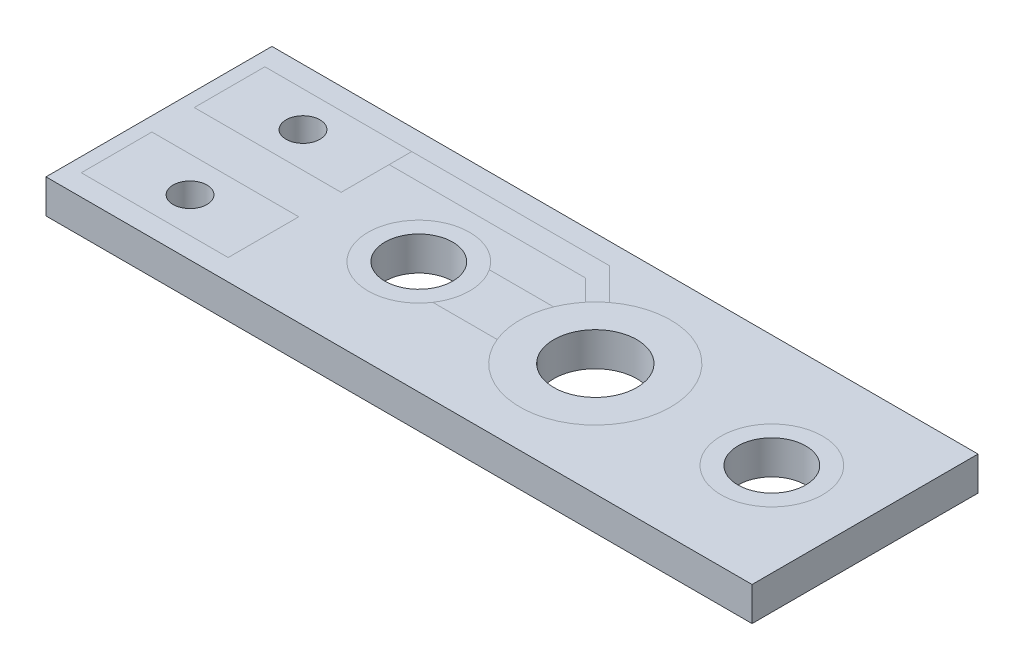
ISO-10303-21;
HEADER;
FILE_DESCRIPTION(('STEP AP214'),'2;1');
FILE_NAME('part.step','',(''),(''),'','','');
FILE_SCHEMA(('AUTOMOTIVE_DESIGN { 1 0 10303 214 1 1 1 1 }'));
ENDSEC;
DATA;
#1=APPLICATION_CONTEXT('core data for automotive mechanical design processes');
#2=APPLICATION_PROTOCOL_DEFINITION('international standard','automotive_design',2000,#1);
#3=PRODUCT_CONTEXT('',#1,'mechanical');
#4=PRODUCT('Part','Part','',(#3));
#5=PRODUCT_RELATED_PRODUCT_CATEGORY('part','',(#4));
#6=PRODUCT_DEFINITION_FORMATION('','',#4);
#7=PRODUCT_DEFINITION_CONTEXT('part definition',#1,'design');
#8=PRODUCT_DEFINITION('design','',#6,#7);
#9=PRODUCT_DEFINITION_SHAPE('','',#8);
#10=(LENGTH_UNIT() NAMED_UNIT(*) SI_UNIT(.MILLI.,.METRE.));
#11=(NAMED_UNIT(*) PLANE_ANGLE_UNIT() SI_UNIT($,.RADIAN.));
#12=(NAMED_UNIT(*) SI_UNIT($,.STERADIAN.) SOLID_ANGLE_UNIT());
#13=UNCERTAINTY_MEASURE_WITH_UNIT(LENGTH_MEASURE(1.E-05),#10,'distance_accuracy_value','');
#14=(GEOMETRIC_REPRESENTATION_CONTEXT(3) GLOBAL_UNCERTAINTY_ASSIGNED_CONTEXT((#13)) GLOBAL_UNIT_ASSIGNED_CONTEXT((#10,
#11,#12)) REPRESENTATION_CONTEXT('',''));
#15=CARTESIAN_POINT('',(0.,0.,0.));
#16=DIRECTION('',(0.,0.,1.));
#17=DIRECTION('',(1.,0.,0.));
#18=AXIS2_PLACEMENT_3D('',#15,#16,#17);
#19=CARTESIAN_POINT('',(0.,-0.762,0.));
#20=DIRECTION('',(0.,1.,0.));
#21=DIRECTION('',(0.,0.,-1.));
#22=AXIS2_PLACEMENT_3D('',#19,#20,#21);
#23=PLANE('',#22);
#24=DIRECTION('',(1.,0.,0.));
#25=VECTOR('',#24,1.);
#26=CARTESIAN_POINT('',(0.,-0.762,1.27));
#27=LINE('',#26,#25);
#28=CARTESIAN_POINT('',(6.89059014024725,-0.762,1.27));
#29=VERTEX_POINT('',#28);
#30=CARTESIAN_POINT('',(9.78323804751884,-0.762,1.27));
#31=VERTEX_POINT('',#30);
#32=EDGE_CURVE('E11',#29,#31,#27,.T.);
#33=ORIENTED_EDGE('',*,*,#32,.F.);
#34=CARTESIAN_POINT('',(3.7465,-0.762,0.));
#35=DIRECTION('',(0.,-1.,0.));
#36=DIRECTION('',(0.,0.,-1.));
#37=AXIS2_PLACEMENT_3D('',#34,#35,#36);
#38=CIRCLE('',#37,3.3909);
#39=CARTESIAN_POINT('',(6.89059014024725,-0.762,-1.27));
#40=VERTEX_POINT('',#39);
#41=EDGE_CURVE('E256',#29,#40,#38,.F.);
#42=ORIENTED_EDGE('',*,*,#41,.T.);
#43=DIRECTION('',(1.,0.,0.));
#44=VECTOR('',#43,1.);
#45=CARTESIAN_POINT('',(0.,-0.762,-1.27));
#46=LINE('',#45,#44);
#47=CARTESIAN_POINT('',(9.78323804751884,-0.762,-1.27));
#48=VERTEX_POINT('',#47);
#49=EDGE_CURVE('E49',#40,#48,#46,.T.);
#50=ORIENTED_EDGE('',*,*,#49,.T.);
#51=CARTESIAN_POINT('',(11.684,-0.762,0.));
#52=DIRECTION('',(0.,-1.,0.));
#53=DIRECTION('',(0.,0.,-1.));
#54=AXIS2_PLACEMENT_3D('',#51,#52,#53);
#55=CIRCLE('',#54,2.286);
#56=EDGE_CURVE('E257',#48,#31,#55,.F.);
#57=ORIENTED_EDGE('',*,*,#56,.T.);
#58=EDGE_LOOP('',(#33,#42,#50,#57));
#59=FACE_BOUND('',#58,.T.);
#60=ADVANCED_FACE('F40',(#59),#23,.F.);
#61=CARTESIAN_POINT('',(-4.191,-0.762,0.));
#62=DIRECTION('',(0.,-1.,0.));
#63=DIRECTION('',(0.,0.,-1.));
#64=AXIS2_PLACEMENT_3D('',#61,#62,#63);
#65=CIRCLE('',#64,2.286);
#66=CARTESIAN_POINT('',(-4.191,-0.762,-2.286));
#67=VERTEX_POINT('',#66);
#68=EDGE_CURVE('E247',#67,#67,#65,.F.);
#69=ORIENTED_EDGE('',*,*,#68,.T.);
#70=EDGE_LOOP('',(#69));
#71=FACE_BOUND('',#70,.T.);
#72=DIRECTION('',(-1.,0.,0.));
#73=VECTOR('',#72,1.);
#74=CARTESIAN_POINT('',(0.,-0.762,-0.952500000000002));
#75=LINE('',#74,#73);
#76=CARTESIAN_POINT('',(-8.636,-0.762,-0.952500000000002));
#77=VERTEX_POINT('',#76);
#78=CARTESIAN_POINT('',(-15.24,-0.762,-0.952500000000003));
#79=VERTEX_POINT('',#78);
#80=EDGE_CURVE('E240',#77,#79,#75,.T.);
#81=ORIENTED_EDGE('',*,*,#80,.F.);
#82=DIRECTION('',(0.,0.,1.));
#83=VECTOR('',#82,1.);
#84=CARTESIAN_POINT('',(-8.636,-0.762,0.));
#85=LINE('',#84,#83);
#86=CARTESIAN_POINT('',(-8.636,-0.762,-4.1275));
#87=VERTEX_POINT('',#86);
#88=EDGE_CURVE('E237',#87,#77,#85,.T.);
#89=ORIENTED_EDGE('',*,*,#88,.F.);
#90=DIRECTION('',(1.,0.,0.));
#91=VECTOR('',#90,1.);
#92=CARTESIAN_POINT('',(0.,-0.762,-4.1275));
#93=LINE('',#92,#91);
#94=CARTESIAN_POINT('',(-15.24,-0.762,-4.1275));
#95=VERTEX_POINT('',#94);
#96=EDGE_CURVE('E234',#95,#87,#93,.T.);
#97=ORIENTED_EDGE('',*,*,#96,.F.);
#98=DIRECTION('',(0.,0.,-1.));
#99=VECTOR('',#98,1.);
#100=CARTESIAN_POINT('',(-15.24,-0.762,0.));
#101=LINE('',#100,#99);
#102=EDGE_CURVE('E244',#79,#95,#101,.T.);
#103=ORIENTED_EDGE('',*,*,#102,.F.);
#104=EDGE_LOOP('',(#81,#89,#97,#103));
#105=FACE_BOUND('',#104,.T.);
#106=DIRECTION('',(0.,0.,1.));
#107=VECTOR('',#106,1.);
#108=CARTESIAN_POINT('',(-15.875,-0.762,-5.07999999999999));
#109=LINE('',#108,#107);
#110=CARTESIAN_POINT('',(-15.875,-0.762,-5.07999999999999));
#111=VERTEX_POINT('',#110);
#112=CARTESIAN_POINT('',(-15.875,-0.762,5.08));
#113=VERTEX_POINT('',#112);
#114=EDGE_CURVE('E199',#111,#113,#109,.T.);
#115=ORIENTED_EDGE('',*,*,#114,.F.);
#116=DIRECTION('',(-1.,0.,0.));
#117=VECTOR('',#116,1.);
#118=CARTESIAN_POINT('',(15.875,-0.762,-5.08));
#119=LINE('',#118,#117);
#120=CARTESIAN_POINT('',(15.875,-0.762,-5.08));
#121=VERTEX_POINT('',#120);
#122=EDGE_CURVE('E216',#121,#111,#119,.T.);
#123=ORIENTED_EDGE('',*,*,#122,.F.);
#124=DIRECTION('',(0.,0.,-1.));
#125=VECTOR('',#124,1.);
#126=CARTESIAN_POINT('',(15.875,-0.762,-5.08));
#127=LINE('',#126,#125);
#128=CARTESIAN_POINT('',(15.875,-0.762,5.08));
#129=VERTEX_POINT('',#128);
#130=EDGE_CURVE('E201',#129,#121,#127,.T.);
#131=ORIENTED_EDGE('',*,*,#130,.F.);
#132=DIRECTION('',(1.,0.,0.));
#133=VECTOR('',#132,1.);
#134=CARTESIAN_POINT('',(15.875,-0.762,5.08));
#135=LINE('',#134,#133);
#136=EDGE_CURVE('E185',#113,#129,#135,.T.);
#137=ORIENTED_EDGE('',*,*,#136,.F.);
#138=EDGE_LOOP('',(#115,#123,#131,#137));
#139=FACE_BOUND('',#138,.T.);
#140=CARTESIAN_POINT('',(1.68738577909666,-0.762,2.69411422090334));
#141=VERTEX_POINT('',#140);
#142=EDGE_CURVE('E252',#141,#29,#38,.F.);
#143=ORIENTED_EDGE('',*,*,#142,.T.);
#144=ORIENTED_EDGE('',*,*,#32,.T.);
#145=EDGE_CURVE('E255',#31,#48,#55,.F.);
#146=ORIENTED_EDGE('',*,*,#145,.T.);
#147=ORIENTED_EDGE('',*,*,#49,.F.);
#148=CARTESIAN_POINT('',(1.13769203312162,-0.762,2.16617723235008));
#149=VERTEX_POINT('',#148);
#150=EDGE_CURVE('E388',#40,#149,#38,.F.);
#151=ORIENTED_EDGE('',*,*,#150,.T.);
#152=DIRECTION('',(0.707106781186546,0.,-0.707106781186549));
#153=VECTOR('',#152,1.);
#154=CARTESIAN_POINT('',(1.65193463273585,-0.762,1.65193463273585));
#155=LINE('',#154,#153);
#156=CARTESIAN_POINT('',(0.192369265471702,-0.762,3.1115));
#157=VERTEX_POINT('',#156);
#158=EDGE_CURVE('E355',#157,#149,#155,.T.);
#159=ORIENTED_EDGE('',*,*,#158,.F.);
#160=DIRECTION('',(1.,0.,0.));
#161=VECTOR('',#160,1.);
#162=CARTESIAN_POINT('',(0.,-0.762,3.1115));
#163=LINE('',#162,#161);
#164=CARTESIAN_POINT('',(-8.636,-0.762,3.1115));
#165=VERTEX_POINT('',#164);
#166=EDGE_CURVE('E359',#165,#157,#163,.T.);
#167=ORIENTED_EDGE('',*,*,#166,.F.);
#168=DIRECTION('',(0.,0.,-1.));
#169=VECTOR('',#168,1.);
#170=CARTESIAN_POINT('',(-8.636,-0.762,0.));
#171=LINE('',#170,#169);
#172=CARTESIAN_POINT('',(-8.636,-0.762,0.952500000000002));
#173=VERTEX_POINT('',#172);
#174=EDGE_CURVE('E221',#165,#173,#171,.T.);
#175=ORIENTED_EDGE('',*,*,#174,.T.);
#176=DIRECTION('',(-1.,0.,0.));
#177=VECTOR('',#176,1.);
#178=CARTESIAN_POINT('',(0.,-0.762,0.952500000000002));
#179=LINE('',#178,#177);
#180=CARTESIAN_POINT('',(-15.24,-0.762,0.952500000000003));
#181=VERTEX_POINT('',#180);
#182=EDGE_CURVE('E218',#173,#181,#179,.T.);
#183=ORIENTED_EDGE('',*,*,#182,.T.);
#184=DIRECTION('',(0.,0.,1.));
#185=VECTOR('',#184,1.);
#186=CARTESIAN_POINT('',(-15.24,-0.762,0.));
#187=LINE('',#186,#185);
#188=CARTESIAN_POINT('',(-15.24,-0.762,4.1275));
#189=VERTEX_POINT('',#188);
#190=EDGE_CURVE('E230',#181,#189,#187,.T.);
#191=ORIENTED_EDGE('',*,*,#190,.T.);
#192=DIRECTION('',(1.,0.,0.));
#193=VECTOR('',#192,1.);
#194=CARTESIAN_POINT('',(0.,-0.762,4.1275));
#195=LINE('',#194,#193);
#196=CARTESIAN_POINT('',(-8.636,-0.762,4.1275));
#197=VERTEX_POINT('',#196);
#198=EDGE_CURVE('E226',#189,#197,#195,.T.);
#199=ORIENTED_EDGE('',*,*,#198,.T.);
#200=DIRECTION('',(1.,0.,0.));
#201=VECTOR('',#200,1.);
#202=CARTESIAN_POINT('',(0.,-0.762,4.1275));
#203=LINE('',#202,#201);
#204=CARTESIAN_POINT('',(0.254000000000001,-0.762,4.1275));
#205=VERTEX_POINT('',#204);
#206=EDGE_CURVE('E352',#197,#205,#203,.T.);
#207=ORIENTED_EDGE('',*,*,#206,.T.);
#208=DIRECTION('',(0.707106781186546,0.,-0.707106781186549));
#209=VECTOR('',#208,1.);
#210=CARTESIAN_POINT('',(2.19075,-0.762,2.19074999999999));
#211=LINE('',#210,#209);
#212=EDGE_CURVE('E348',#205,#141,#211,.T.);
#213=ORIENTED_EDGE('',*,*,#212,.T.);
#214=EDGE_LOOP('',(#143,#144,#146,#147,#151,#159,#167,#175,#183,#191,#199,#207,#213));
#215=FACE_BOUND('',#214,.T.);
#216=ADVANCED_FACE('F197',(#71,#105,#139,#215),#23,.F.);
#217=CARTESIAN_POINT('',(0.,0.762,0.));
#218=DIRECTION('',(0.,-1.,0.));
#219=DIRECTION('',(0.,0.,-1.));
#220=AXIS2_PLACEMENT_3D('',#217,#218,#219);
#221=PLANE('',#220);
#222=DIRECTION('',(0.,0.,1.));
#223=VECTOR('',#222,1.);
#224=CARTESIAN_POINT('',(-15.24,0.762,0.));
#225=LINE('',#224,#223);
#226=CARTESIAN_POINT('',(-15.24,0.762,0.952500000000003));
#227=VERTEX_POINT('',#226);
#228=CARTESIAN_POINT('',(-15.24,0.762,4.1275));
#229=VERTEX_POINT('',#228);
#230=EDGE_CURVE('E295',#227,#229,#225,.T.);
#231=ORIENTED_EDGE('',*,*,#230,.F.);
#232=DIRECTION('',(-1.,0.,0.));
#233=VECTOR('',#232,1.);
#234=CARTESIAN_POINT('',(0.,0.762,0.952500000000002));
#235=LINE('',#234,#233);
#236=CARTESIAN_POINT('',(-8.636,0.762,0.952500000000002));
#237=VERTEX_POINT('',#236);
#238=EDGE_CURVE('E192',#237,#227,#235,.T.);
#239=ORIENTED_EDGE('',*,*,#238,.F.);
#240=DIRECTION('',(0.,0.,-1.));
#241=VECTOR('',#240,1.);
#242=CARTESIAN_POINT('',(-8.636,0.762,0.));
#243=LINE('',#242,#241);
#244=CARTESIAN_POINT('',(-8.636,0.762,4.1275));
#245=VERTEX_POINT('',#244);
#246=EDGE_CURVE('E289',#245,#237,#243,.T.);
#247=ORIENTED_EDGE('',*,*,#246,.F.);
#248=DIRECTION('',(1.,0.,0.));
#249=VECTOR('',#248,1.);
#250=CARTESIAN_POINT('',(0.,0.762,4.1275));
#251=LINE('',#250,#249);
#252=EDGE_CURVE('E292',#229,#245,#251,.T.);
#253=ORIENTED_EDGE('',*,*,#252,.F.);
#254=EDGE_LOOP('',(#231,#239,#247,#253));
#255=FACE_BOUND('',#254,.T.);
#256=DIRECTION('',(0.,0.,1.));
#257=VECTOR('',#256,1.);
#258=CARTESIAN_POINT('',(-15.875,0.762,-5.07999999999999));
#259=LINE('',#258,#257);
#260=CARTESIAN_POINT('',(-15.875,0.762,-5.07999999999999));
#261=VERTEX_POINT('',#260);
#262=CARTESIAN_POINT('',(-15.875,0.762,5.08));
#263=VERTEX_POINT('',#262);
#264=EDGE_CURVE('E270',#261,#263,#259,.T.);
#265=ORIENTED_EDGE('',*,*,#264,.T.);
#266=DIRECTION('',(1.,0.,0.));
#267=VECTOR('',#266,1.);
#268=CARTESIAN_POINT('',(15.875,0.762,5.08));
#269=LINE('',#268,#267);
#270=CARTESIAN_POINT('',(15.875,0.762,5.08));
#271=VERTEX_POINT('',#270);
#272=EDGE_CURVE('E187',#263,#271,#269,.T.);
#273=ORIENTED_EDGE('',*,*,#272,.T.);
#274=DIRECTION('',(0.,0.,-1.));
#275=VECTOR('',#274,1.);
#276=CARTESIAN_POINT('',(15.875,0.762,-5.08));
#277=LINE('',#276,#275);
#278=CARTESIAN_POINT('',(15.875,0.762,-5.08));
#279=VERTEX_POINT('',#278);
#280=EDGE_CURVE('E278',#271,#279,#277,.T.);
#281=ORIENTED_EDGE('',*,*,#280,.T.);
#282=DIRECTION('',(-1.,0.,0.));
#283=VECTOR('',#282,1.);
#284=CARTESIAN_POINT('',(15.875,0.762,-5.08));
#285=LINE('',#284,#283);
#286=EDGE_CURVE('E280',#279,#261,#285,.T.);
#287=ORIENTED_EDGE('',*,*,#286,.T.);
#288=EDGE_LOOP('',(#265,#273,#281,#287));
#289=FACE_BOUND('',#288,.T.);
#290=CARTESIAN_POINT('',(11.684,0.762,0.));
#291=DIRECTION('',(0.,-1.,0.));
#292=DIRECTION('',(0.,0.,-1.));
#293=AXIS2_PLACEMENT_3D('',#290,#291,#292);
#294=CIRCLE('',#293,2.286);
#295=CARTESIAN_POINT('',(11.684,0.762,-2.286));
#296=VERTEX_POINT('',#295);
#297=EDGE_CURVE('E324',#296,#296,#294,.F.);
#298=ORIENTED_EDGE('',*,*,#297,.F.);
#299=EDGE_LOOP('',(#298));
#300=FACE_BOUND('',#299,.T.);
#301=DIRECTION('',(1.,0.,0.));
#302=VECTOR('',#301,1.);
#303=CARTESIAN_POINT('',(0.,0.762,-3.1115));
#304=LINE('',#303,#302);
#305=CARTESIAN_POINT('',(-8.636,0.762,-3.1115));
#306=VERTEX_POINT('',#305);
#307=CARTESIAN_POINT('',(0.192369265471702,0.762,-3.1115));
#308=VERTEX_POINT('',#307);
#309=EDGE_CURVE('E345',#306,#308,#304,.T.);
#310=ORIENTED_EDGE('',*,*,#309,.F.);
#311=DIRECTION('',(0.,0.,1.));
#312=VECTOR('',#311,1.);
#313=CARTESIAN_POINT('',(-8.636,0.762,0.));
#314=LINE('',#313,#312);
#315=CARTESIAN_POINT('',(-8.636,0.762,-0.952500000000002));
#316=VERTEX_POINT('',#315);
#317=EDGE_CURVE('E302',#306,#316,#314,.T.);
#318=ORIENTED_EDGE('',*,*,#317,.T.);
#319=DIRECTION('',(-1.,0.,0.));
#320=VECTOR('',#319,1.);
#321=CARTESIAN_POINT('',(0.,0.762,-0.952500000000002));
#322=LINE('',#321,#320);
#323=CARTESIAN_POINT('',(-15.24,0.762,-0.952500000000003));
#324=VERTEX_POINT('',#323);
#325=EDGE_CURVE('E307',#316,#324,#322,.T.);
#326=ORIENTED_EDGE('',*,*,#325,.T.);
#327=DIRECTION('',(0.,0.,-1.));
#328=VECTOR('',#327,1.);
#329=CARTESIAN_POINT('',(-15.24,0.762,0.));
#330=LINE('',#329,#328);
#331=CARTESIAN_POINT('',(-15.24,0.762,-4.1275));
#332=VERTEX_POINT('',#331);
#333=EDGE_CURVE('E311',#324,#332,#330,.T.);
#334=ORIENTED_EDGE('',*,*,#333,.T.);
#335=DIRECTION('',(1.,0.,0.));
#336=VECTOR('',#335,1.);
#337=CARTESIAN_POINT('',(0.,0.762,-4.1275));
#338=LINE('',#337,#336);
#339=CARTESIAN_POINT('',(-8.636,0.762,-4.1275));
#340=VERTEX_POINT('',#339);
#341=EDGE_CURVE('E298',#332,#340,#338,.T.);
#342=ORIENTED_EDGE('',*,*,#341,.T.);
#343=DIRECTION('',(1.,0.,0.));
#344=VECTOR('',#343,1.);
#345=CARTESIAN_POINT('',(0.,0.762,-4.1275));
#346=LINE('',#345,#344);
#347=CARTESIAN_POINT('',(0.254000000000002,0.762,-4.1275));
#348=VERTEX_POINT('',#347);
#349=EDGE_CURVE('E339',#340,#348,#346,.T.);
#350=ORIENTED_EDGE('',*,*,#349,.T.);
#351=DIRECTION('',(0.707106781186546,0.,0.707106781186549));
#352=VECTOR('',#351,1.);
#353=CARTESIAN_POINT('',(2.19075,0.762,-2.19075));
#354=LINE('',#353,#352);
#355=CARTESIAN_POINT('',(1.68738577909666,0.762,-2.69411422090334));
#356=VERTEX_POINT('',#355);
#357=EDGE_CURVE('E336',#348,#356,#354,.T.);
#358=ORIENTED_EDGE('',*,*,#357,.T.);
#359=CARTESIAN_POINT('',(3.7465,0.762,0.));
#360=DIRECTION('',(0.,-1.,0.));
#361=DIRECTION('',(0.,0.,-1.));
#362=AXIS2_PLACEMENT_3D('',#359,#360,#361);
#363=CIRCLE('',#362,3.3909);
#364=CARTESIAN_POINT('',(0.602409859752746,0.762,1.27));
#365=VERTEX_POINT('',#364);
#366=EDGE_CURVE('E325',#365,#356,#363,.F.);
#367=ORIENTED_EDGE('',*,*,#366,.F.);
#368=DIRECTION('',(1.,0.,0.));
#369=VECTOR('',#368,1.);
#370=CARTESIAN_POINT('',(0.,0.762,1.27));
#371=LINE('',#370,#369);
#372=CARTESIAN_POINT('',(-2.29023804751884,0.762,1.27));
#373=VERTEX_POINT('',#372);
#374=EDGE_CURVE('E333',#373,#365,#371,.T.);
#375=ORIENTED_EDGE('',*,*,#374,.F.);
#376=CARTESIAN_POINT('',(-4.191,0.762,0.));
#377=DIRECTION('',(0.,-1.,0.));
#378=DIRECTION('',(0.,0.,-1.));
#379=AXIS2_PLACEMENT_3D('',#376,#377,#378);
#380=CIRCLE('',#379,2.286);
#381=CARTESIAN_POINT('',(-2.29023804751884,0.762,-1.27));
#382=VERTEX_POINT('',#381);
#383=EDGE_CURVE('E315',#382,#373,#380,.F.);
#384=ORIENTED_EDGE('',*,*,#383,.F.);
#385=DIRECTION('',(1.,0.,0.));
#386=VECTOR('',#385,1.);
#387=CARTESIAN_POINT('',(0.,0.762,-1.27));
#388=LINE('',#387,#386);
#389=CARTESIAN_POINT('',(0.602409859752746,0.762,-1.27));
#390=VERTEX_POINT('',#389);
#391=EDGE_CURVE('E329',#382,#390,#388,.T.);
#392=ORIENTED_EDGE('',*,*,#391,.T.);
#393=CARTESIAN_POINT('',(1.13769203312162,0.762,-2.16617723235008));
#394=VERTEX_POINT('',#393);
#395=EDGE_CURVE('E319',#394,#390,#363,.F.);
#396=ORIENTED_EDGE('',*,*,#395,.F.);
#397=DIRECTION('',(0.707106781186546,0.,0.707106781186549));
#398=VECTOR('',#397,1.);
#399=CARTESIAN_POINT('',(1.65193463273585,0.762,-1.65193463273584));
#400=LINE('',#399,#398);
#401=EDGE_CURVE('E342',#308,#394,#400,.T.);
#402=ORIENTED_EDGE('',*,*,#401,.F.);
#403=EDGE_LOOP('',(#310,#318,#326,#334,#342,#350,#358,#367,#375,#384,#392,#396,#402));
#404=FACE_BOUND('',#403,.T.);
#405=ADVANCED_FACE('F482',(#255,#289,#300,#404),#221,.F.);
#406=EDGE_CURVE('E303',#340,#306,#314,.T.);
#407=ORIENTED_EDGE('',*,*,#406,.T.);
#408=ORIENTED_EDGE('',*,*,#309,.T.);
#409=ORIENTED_EDGE('',*,*,#401,.T.);
#410=EDGE_CURVE('E416',#356,#394,#363,.F.);
#411=ORIENTED_EDGE('',*,*,#410,.F.);
#412=ORIENTED_EDGE('',*,*,#357,.F.);
#413=ORIENTED_EDGE('',*,*,#349,.F.);
#414=EDGE_LOOP('',(#407,#408,#409,#411,#412,#413));
#415=FACE_BOUND('',#414,.T.);
#416=ADVANCED_FACE('F492',(#415),#221,.F.);
#417=EDGE_CURVE('E314',#373,#382,#380,.F.);
#418=ORIENTED_EDGE('',*,*,#417,.F.);
#419=ORIENTED_EDGE('',*,*,#374,.T.);
#420=EDGE_CURVE('E320',#390,#365,#363,.F.);
#421=ORIENTED_EDGE('',*,*,#420,.F.);
#422=ORIENTED_EDGE('',*,*,#391,.F.);
#423=EDGE_LOOP('',(#418,#419,#421,#422));
#424=FACE_BOUND('',#423,.T.);
#425=ADVANCED_FACE('F479',(#424),#221,.F.);
#426=ORIENTED_EDGE('',*,*,#297,.T.);
#427=EDGE_LOOP('',(#426));
#428=FACE_BOUND('',#427,.T.);
#429=CARTESIAN_POINT('',(11.684,0.762,0.));
#430=DIRECTION('',(0.,1.,0.));
#431=DIRECTION('',(0.,0.,1.));
#432=AXIS2_PLACEMENT_3D('',#429,#430,#431);
#433=CIRCLE('',#432,1.524);
#434=CARTESIAN_POINT('',(11.684,0.762,1.524));
#435=VERTEX_POINT('',#434);
#436=EDGE_CURVE('E266',#435,#435,#433,.T.);
#437=ORIENTED_EDGE('',*,*,#436,.F.);
#438=EDGE_LOOP('',(#437));
#439=FACE_BOUND('',#438,.T.);
#440=ADVANCED_FACE('F506',(#428,#439),#221,.F.);
#441=ORIENTED_EDGE('',*,*,#420,.T.);
#442=ORIENTED_EDGE('',*,*,#366,.T.);
#443=ORIENTED_EDGE('',*,*,#410,.T.);
#444=ORIENTED_EDGE('',*,*,#395,.T.);
#445=EDGE_LOOP('',(#441,#442,#443,#444));
#446=FACE_BOUND('',#445,.T.);
#447=CARTESIAN_POINT('',(3.7465,0.762,0.));
#448=DIRECTION('',(0.,1.,0.));
#449=DIRECTION('',(0.,0.,1.));
#450=AXIS2_PLACEMENT_3D('',#447,#448,#449);
#451=CIRCLE('',#450,1.8669);
#452=CARTESIAN_POINT('',(3.7465,0.762,1.8669));
#453=VERTEX_POINT('',#452);
#454=EDGE_CURVE('E271',#453,#453,#451,.T.);
#455=ORIENTED_EDGE('',*,*,#454,.F.);
#456=EDGE_LOOP('',(#455));
#457=FACE_BOUND('',#456,.T.);
#458=ADVANCED_FACE('F487',(#446,#457),#221,.F.);
#459=CARTESIAN_POINT('',(-11.938,0.762,-2.54));
#460=DIRECTION('',(0.,-1.,0.));
#461=DIRECTION('',(0.,0.,-1.));
#462=AXIS2_PLACEMENT_3D('',#459,#460,#461);
#463=CIRCLE('',#462,0.762000000000001);
#464=CARTESIAN_POINT('',(-11.938,0.762,-3.302));
#465=VERTEX_POINT('',#464);
#466=EDGE_CURVE('E260',#465,#465,#463,.T.);
#467=ORIENTED_EDGE('',*,*,#466,.T.);
#468=EDGE_LOOP('',(#467));
#469=FACE_BOUND('',#468,.T.);
#470=ORIENTED_EDGE('',*,*,#333,.F.);
#471=ORIENTED_EDGE('',*,*,#325,.F.);
#472=ORIENTED_EDGE('',*,*,#317,.F.);
#473=ORIENTED_EDGE('',*,*,#406,.F.);
#474=ORIENTED_EDGE('',*,*,#341,.F.);
#475=EDGE_LOOP('',(#470,#471,#472,#473,#474));
#476=FACE_BOUND('',#475,.T.);
#477=ADVANCED_FACE('F496',(#469,#476),#221,.F.);
#478=ORIENTED_EDGE('',*,*,#383,.T.);
#479=ORIENTED_EDGE('',*,*,#417,.T.);
#480=EDGE_LOOP('',(#478,#479));
#481=FACE_BOUND('',#480,.T.);
#482=CARTESIAN_POINT('',(-4.191,0.762,0.));
#483=DIRECTION('',(0.,1.,0.));
#484=DIRECTION('',(0.,0.,1.));
#485=AXIS2_PLACEMENT_3D('',#482,#483,#484);
#486=CIRCLE('',#485,1.524);
#487=CARTESIAN_POINT('',(-4.191,0.762,1.524));
#488=VERTEX_POINT('',#487);
#489=EDGE_CURVE('E267',#488,#488,#486,.T.);
#490=ORIENTED_EDGE('',*,*,#489,.F.);
#491=EDGE_LOOP('',(#490));
#492=FACE_BOUND('',#491,.T.);
#493=ADVANCED_FACE('F474',(#481,#492),#221,.F.);
#494=CARTESIAN_POINT('',(-15.875,0.762,-5.07999999999999));
#495=DIRECTION('',(1.,0.,0.));
#496=DIRECTION('',(0.,0.,-1.));
#497=AXIS2_PLACEMENT_3D('',#494,#495,#496);
#498=PLANE('',#497);
#499=DIRECTION('',(0.,-1.,0.));
#500=VECTOR('',#499,1.);
#501=CARTESIAN_POINT('',(-15.875,0.762,-5.07999999999999));
#502=LINE('',#501,#500);
#503=EDGE_CURVE('E204',#261,#111,#502,.T.);
#504=ORIENTED_EDGE('',*,*,#503,.T.);
#505=ORIENTED_EDGE('',*,*,#114,.T.);
#506=DIRECTION('',(0.,-1.,0.));
#507=VECTOR('',#506,1.);
#508=CARTESIAN_POINT('',(-15.875,0.762,5.08));
#509=LINE('',#508,#507);
#510=EDGE_CURVE('E181',#263,#113,#509,.T.);
#511=ORIENTED_EDGE('',*,*,#510,.F.);
#512=ORIENTED_EDGE('',*,*,#264,.F.);
#513=EDGE_LOOP('',(#504,#505,#511,#512));
#514=FACE_BOUND('',#513,.T.);
#515=ADVANCED_FACE('F42',(#514),#498,.F.);
#516=CARTESIAN_POINT('',(15.875,0.762,5.08));
#517=DIRECTION('',(0.,0.,-1.));
#518=DIRECTION('',(-1.,0.,0.));
#519=AXIS2_PLACEMENT_3D('',#516,#517,#518);
#520=PLANE('',#519);
#521=ORIENTED_EDGE('',*,*,#510,.T.);
#522=ORIENTED_EDGE('',*,*,#136,.T.);
#523=DIRECTION('',(0.,-1.,0.));
#524=VECTOR('',#523,1.);
#525=CARTESIAN_POINT('',(15.875,0.762,5.08));
#526=LINE('',#525,#524);
#527=EDGE_CURVE('E193',#271,#129,#526,.T.);
#528=ORIENTED_EDGE('',*,*,#527,.F.);
#529=ORIENTED_EDGE('',*,*,#272,.F.);
#530=EDGE_LOOP('',(#521,#522,#528,#529));
#531=FACE_BOUND('',#530,.T.);
#532=ADVANCED_FACE('F183',(#531),#520,.F.);
#533=CARTESIAN_POINT('',(15.875,0.762,-5.08));
#534=DIRECTION('',(-1.,0.,0.));
#535=DIRECTION('',(0.,0.,1.));
#536=AXIS2_PLACEMENT_3D('',#533,#534,#535);
#537=PLANE('',#536);
#538=ORIENTED_EDGE('',*,*,#527,.T.);
#539=ORIENTED_EDGE('',*,*,#130,.T.);
#540=DIRECTION('',(0.,-1.,0.));
#541=VECTOR('',#540,1.);
#542=CARTESIAN_POINT('',(15.875,0.762,-5.08));
#543=LINE('',#542,#541);
#544=EDGE_CURVE('E283',#279,#121,#543,.T.);
#545=ORIENTED_EDGE('',*,*,#544,.F.);
#546=ORIENTED_EDGE('',*,*,#280,.F.);
#547=EDGE_LOOP('',(#538,#539,#545,#546));
#548=FACE_BOUND('',#547,.T.);
#549=ADVANCED_FACE('F720',(#548),#537,.F.);
#550=CARTESIAN_POINT('',(15.875,0.762,-5.08));
#551=DIRECTION('',(0.,0.,1.));
#552=DIRECTION('',(1.,0.,0.));
#553=AXIS2_PLACEMENT_3D('',#550,#551,#552);
#554=PLANE('',#553);
#555=ORIENTED_EDGE('',*,*,#544,.T.);
#556=ORIENTED_EDGE('',*,*,#122,.T.);
#557=ORIENTED_EDGE('',*,*,#503,.F.);
#558=ORIENTED_EDGE('',*,*,#286,.F.);
#559=EDGE_LOOP('',(#555,#556,#557,#558));
#560=FACE_BOUND('',#559,.T.);
#561=ADVANCED_FACE('F716',(#560),#554,.F.);
#562=ORIENTED_EDGE('',*,*,#238,.T.);
#563=ORIENTED_EDGE('',*,*,#230,.T.);
#564=ORIENTED_EDGE('',*,*,#252,.T.);
#565=ORIENTED_EDGE('',*,*,#246,.T.);
#566=EDGE_LOOP('',(#562,#563,#564,#565));
#567=FACE_BOUND('',#566,.T.);
#568=CARTESIAN_POINT('',(-11.938,0.762,2.54));
#569=DIRECTION('',(0.,1.,0.));
#570=DIRECTION('',(0.,0.,1.));
#571=AXIS2_PLACEMENT_3D('',#568,#569,#570);
#572=CIRCLE('',#571,0.762000000000001);
#573=CARTESIAN_POINT('',(-11.938,0.762,3.302));
#574=VERTEX_POINT('',#573);
#575=EDGE_CURVE('E263',#574,#574,#572,.T.);
#576=ORIENTED_EDGE('',*,*,#575,.F.);
#577=EDGE_LOOP('',(#576));
#578=FACE_BOUND('',#577,.T.);
#579=ADVANCED_FACE('F505',(#567,#578),#221,.F.);
#580=CARTESIAN_POINT('',(11.684,0.,0.));
#581=DIRECTION('',(0.,1.,0.));
#582=DIRECTION('',(0.,0.,1.));
#583=AXIS2_PLACEMENT_3D('',#580,#581,#582);
#584=CYLINDRICAL_SURFACE('',#583,1.524);
#585=ORIENTED_EDGE('',*,*,#436,.T.);
#586=EDGE_LOOP('',(#585));
#587=FACE_BOUND('',#586,.T.);
#588=CARTESIAN_POINT('',(11.684,-0.762,0.));
#589=DIRECTION('',(0.,1.,0.));
#590=DIRECTION('',(0.,0.,1.));
#591=AXIS2_PLACEMENT_3D('',#588,#589,#590);
#592=CIRCLE('',#591,1.524);
#593=CARTESIAN_POINT('',(11.684,-0.762,1.524));
#594=VERTEX_POINT('',#593);
#595=EDGE_CURVE('E212',#594,#594,#592,.T.);
#596=ORIENTED_EDGE('',*,*,#595,.F.);
#597=EDGE_LOOP('',(#596));
#598=FACE_BOUND('',#597,.T.);
#599=ADVANCED_FACE('F547',(#587,#598),#584,.F.);
#600=CARTESIAN_POINT('',(3.7465,0.,0.));
#601=DIRECTION('',(0.,1.,0.));
#602=DIRECTION('',(0.,0.,1.));
#603=AXIS2_PLACEMENT_3D('',#600,#601,#602);
#604=CYLINDRICAL_SURFACE('',#603,1.8669);
#605=ORIENTED_EDGE('',*,*,#454,.T.);
#606=EDGE_LOOP('',(#605));
#607=FACE_BOUND('',#606,.T.);
#608=CARTESIAN_POINT('',(3.7465,-0.762,0.));
#609=DIRECTION('',(0.,1.,0.));
#610=DIRECTION('',(0.,0.,1.));
#611=AXIS2_PLACEMENT_3D('',#608,#609,#610);
#612=CIRCLE('',#611,1.8669);
#613=CARTESIAN_POINT('',(3.7465,-0.762,1.8669));
#614=VERTEX_POINT('',#613);
#615=EDGE_CURVE('E209',#614,#614,#612,.T.);
#616=ORIENTED_EDGE('',*,*,#615,.F.);
#617=EDGE_LOOP('',(#616));
#618=FACE_BOUND('',#617,.T.);
#619=ADVANCED_FACE('F544',(#607,#618),#604,.F.);
#620=CARTESIAN_POINT('',(-4.191,0.,0.));
#621=DIRECTION('',(0.,1.,0.));
#622=DIRECTION('',(0.,0.,1.));
#623=AXIS2_PLACEMENT_3D('',#620,#621,#622);
#624=CYLINDRICAL_SURFACE('',#623,1.524);
#625=ORIENTED_EDGE('',*,*,#489,.T.);
#626=EDGE_LOOP('',(#625));
#627=FACE_BOUND('',#626,.T.);
#628=CARTESIAN_POINT('',(-4.191,-0.762,0.));
#629=DIRECTION('',(0.,1.,0.));
#630=DIRECTION('',(0.,0.,1.));
#631=AXIS2_PLACEMENT_3D('',#628,#629,#630);
#632=CIRCLE('',#631,1.524);
#633=CARTESIAN_POINT('',(-4.191,-0.762,1.524));
#634=VERTEX_POINT('',#633);
#635=EDGE_CURVE('E206',#634,#634,#632,.T.);
#636=ORIENTED_EDGE('',*,*,#635,.F.);
#637=EDGE_LOOP('',(#636));
#638=FACE_BOUND('',#637,.T.);
#639=ADVANCED_FACE('F546',(#627,#638),#624,.F.);
#640=CARTESIAN_POINT('',(-11.938,0.,2.54));
#641=DIRECTION('',(0.,1.,0.));
#642=DIRECTION('',(0.,0.,1.));
#643=AXIS2_PLACEMENT_3D('',#640,#641,#642);
#644=CYLINDRICAL_SURFACE('',#643,0.762000000000001);
#645=ORIENTED_EDGE('',*,*,#575,.T.);
#646=EDGE_LOOP('',(#645));
#647=FACE_BOUND('',#646,.T.);
#648=CARTESIAN_POINT('',(-11.938,-0.762,2.54));
#649=DIRECTION('',(0.,1.,0.));
#650=DIRECTION('',(0.,0.,1.));
#651=AXIS2_PLACEMENT_3D('',#648,#649,#650);
#652=CIRCLE('',#651,0.762000000000001);
#653=CARTESIAN_POINT('',(-11.938,-0.762,3.302));
#654=VERTEX_POINT('',#653);
#655=EDGE_CURVE('E532',#654,#654,#652,.T.);
#656=ORIENTED_EDGE('',*,*,#655,.F.);
#657=EDGE_LOOP('',(#656));
#658=FACE_BOUND('',#657,.T.);
#659=ADVANCED_FACE('F554',(#647,#658),#644,.F.);
#660=CARTESIAN_POINT('',(-11.938,0.,-2.54));
#661=DIRECTION('',(0.,1.,0.));
#662=DIRECTION('',(0.,0.,1.));
#663=AXIS2_PLACEMENT_3D('',#660,#661,#662);
#664=CYLINDRICAL_SURFACE('',#663,0.762000000000001);
#665=ORIENTED_EDGE('',*,*,#466,.F.);
#666=EDGE_LOOP('',(#665));
#667=FACE_BOUND('',#666,.T.);
#668=CARTESIAN_POINT('',(-11.938,-0.762,-2.54));
#669=DIRECTION('',(0.,-1.,0.));
#670=DIRECTION('',(0.,0.,-1.));
#671=AXIS2_PLACEMENT_3D('',#668,#669,#670);
#672=CIRCLE('',#671,0.762000000000001);
#673=CARTESIAN_POINT('',(-11.938,-0.762,-3.302));
#674=VERTEX_POINT('',#673);
#675=EDGE_CURVE('E534',#674,#674,#672,.T.);
#676=ORIENTED_EDGE('',*,*,#675,.T.);
#677=EDGE_LOOP('',(#676));
#678=FACE_BOUND('',#677,.T.);
#679=ADVANCED_FACE('F560',(#667,#678),#664,.F.);
#680=EDGE_CURVE('E222',#197,#165,#171,.T.);
#681=ORIENTED_EDGE('',*,*,#680,.T.);
#682=ORIENTED_EDGE('',*,*,#166,.T.);
#683=ORIENTED_EDGE('',*,*,#158,.T.);
#684=EDGE_CURVE('E251',#149,#141,#38,.F.);
#685=ORIENTED_EDGE('',*,*,#684,.T.);
#686=ORIENTED_EDGE('',*,*,#212,.F.);
#687=ORIENTED_EDGE('',*,*,#206,.F.);
#688=EDGE_LOOP('',(#681,#682,#683,#685,#686,#687));
#689=FACE_BOUND('',#688,.T.);
#690=ADVANCED_FACE('F516',(#689),#23,.F.);
#691=ORIENTED_EDGE('',*,*,#56,.F.);
#692=ORIENTED_EDGE('',*,*,#145,.F.);
#693=EDGE_LOOP('',(#691,#692));
#694=FACE_BOUND('',#693,.T.);
#695=ORIENTED_EDGE('',*,*,#595,.T.);
#696=EDGE_LOOP('',(#695));
#697=FACE_BOUND('',#696,.T.);
#698=ADVANCED_FACE('F369',(#694,#697),#23,.F.);
#699=ORIENTED_EDGE('',*,*,#142,.F.);
#700=ORIENTED_EDGE('',*,*,#684,.F.);
#701=ORIENTED_EDGE('',*,*,#150,.F.);
#702=ORIENTED_EDGE('',*,*,#41,.F.);
#703=EDGE_LOOP('',(#699,#700,#701,#702));
#704=FACE_BOUND('',#703,.T.);
#705=ORIENTED_EDGE('',*,*,#615,.T.);
#706=EDGE_LOOP('',(#705));
#707=FACE_BOUND('',#706,.T.);
#708=ADVANCED_FACE('F542',(#704,#707),#23,.F.);
#709=ORIENTED_EDGE('',*,*,#675,.F.);
#710=EDGE_LOOP('',(#709));
#711=FACE_BOUND('',#710,.T.);
#712=ORIENTED_EDGE('',*,*,#102,.T.);
#713=ORIENTED_EDGE('',*,*,#96,.T.);
#714=ORIENTED_EDGE('',*,*,#88,.T.);
#715=ORIENTED_EDGE('',*,*,#80,.T.);
#716=EDGE_LOOP('',(#712,#713,#714,#715));
#717=FACE_BOUND('',#716,.T.);
#718=ADVANCED_FACE('F524',(#711,#717),#23,.F.);
#719=ORIENTED_EDGE('',*,*,#68,.F.);
#720=EDGE_LOOP('',(#719));
#721=FACE_BOUND('',#720,.T.);
#722=ORIENTED_EDGE('',*,*,#635,.T.);
#723=EDGE_LOOP('',(#722));
#724=FACE_BOUND('',#723,.T.);
#725=ADVANCED_FACE('F519',(#721,#724),#23,.F.);
#726=ORIENTED_EDGE('',*,*,#182,.F.);
#727=ORIENTED_EDGE('',*,*,#174,.F.);
#728=ORIENTED_EDGE('',*,*,#680,.F.);
#729=ORIENTED_EDGE('',*,*,#198,.F.);
#730=ORIENTED_EDGE('',*,*,#190,.F.);
#731=EDGE_LOOP('',(#726,#727,#728,#729,#730));
#732=FACE_BOUND('',#731,.T.);
#733=ORIENTED_EDGE('',*,*,#655,.T.);
#734=EDGE_LOOP('',(#733));
#735=FACE_BOUND('',#734,.T.);
#736=ADVANCED_FACE('F511',(#732,#735),#23,.F.);
#737=CLOSED_SHELL('',(#60,#216,#405,#416,#425,#440,#458,#477,#493,#515,#532,#549,#561,#579,#599,
#619,#639,#659,#679,#690,#698,#708,#718,#725,#736));
#738=MANIFOLD_SOLID_BREP('B2',#737);
#739=ADVANCED_BREP_SHAPE_REPRESENTATION('',(#18,#738),#14);
#740=SHAPE_DEFINITION_REPRESENTATION(#9,#739);
ENDSEC;
END-ISO-10303-21;
